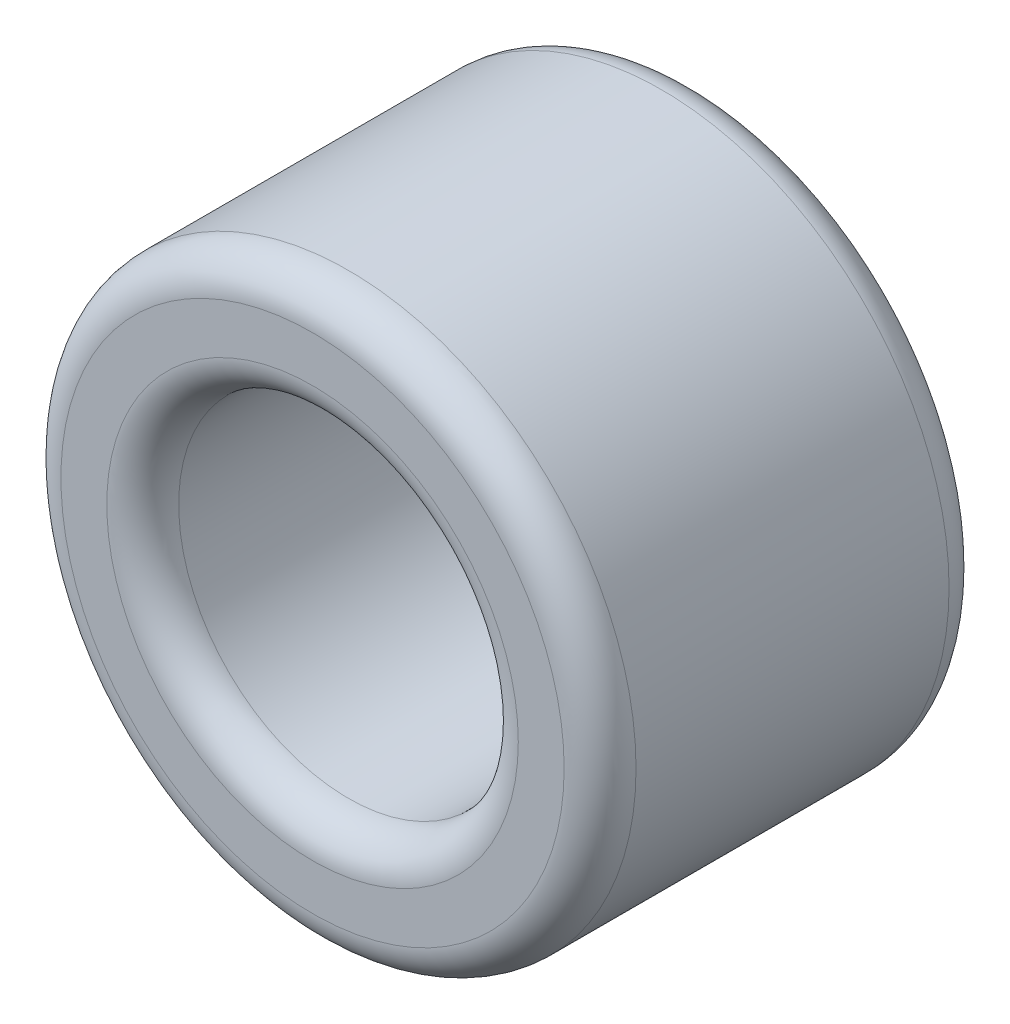
ISO-10303-21;
HEADER;
FILE_DESCRIPTION(('STEP AP214'),'2;1');
FILE_NAME('part.step','',(''),(''),'','','');
FILE_SCHEMA(('AUTOMOTIVE_DESIGN { 1 0 10303 214 1 1 1 1 }'));
ENDSEC;
DATA;
#1=APPLICATION_CONTEXT('core data for automotive mechanical design processes');
#2=APPLICATION_PROTOCOL_DEFINITION('international standard','automotive_design',2000,#1);
#3=PRODUCT_CONTEXT('',#1,'mechanical');
#4=PRODUCT('Part','Part','',(#3));
#5=PRODUCT_RELATED_PRODUCT_CATEGORY('part','',(#4));
#6=PRODUCT_DEFINITION_FORMATION('','',#4);
#7=PRODUCT_DEFINITION_CONTEXT('part definition',#1,'design');
#8=PRODUCT_DEFINITION('design','',#6,#7);
#9=PRODUCT_DEFINITION_SHAPE('','',#8);
#10=(LENGTH_UNIT() NAMED_UNIT(*) SI_UNIT(.MILLI.,.METRE.));
#11=(NAMED_UNIT(*) PLANE_ANGLE_UNIT() SI_UNIT($,.RADIAN.));
#12=(NAMED_UNIT(*) SI_UNIT($,.STERADIAN.) SOLID_ANGLE_UNIT());
#13=UNCERTAINTY_MEASURE_WITH_UNIT(LENGTH_MEASURE(1.E-05),#10,'distance_accuracy_value','');
#14=(GEOMETRIC_REPRESENTATION_CONTEXT(3) GLOBAL_UNCERTAINTY_ASSIGNED_CONTEXT((#13)) GLOBAL_UNIT_ASSIGNED_CONTEXT((#10,
#11,#12)) REPRESENTATION_CONTEXT('',''));
#15=CARTESIAN_POINT('',(0.,0.,0.));
#16=DIRECTION('',(0.,0.,1.));
#17=DIRECTION('',(1.,0.,0.));
#18=AXIS2_PLACEMENT_3D('',#15,#16,#17);
#19=CARTESIAN_POINT('',(0.,0.,170.));
#20=DIRECTION('',(0.,0.,-1.));
#21=DIRECTION('',(-1.,0.,0.));
#22=AXIS2_PLACEMENT_3D('',#19,#20,#21);
#23=CYLINDRICAL_SURFACE('',#22,127.);
#24=CARTESIAN_POINT('',(0.,0.,15.875));
#25=DIRECTION('',(0.,0.,1.));
#26=DIRECTION('',(1.,0.,0.));
#27=AXIS2_PLACEMENT_3D('',#24,#25,#26);
#28=CIRCLE('',#27,127.);
#29=CARTESIAN_POINT('',(127.,0.,15.875));
#30=VERTEX_POINT('',#29);
#31=EDGE_CURVE('E10',#30,#30,#28,.T.);
#32=ORIENTED_EDGE('',*,*,#31,.T.);
#33=EDGE_LOOP('',(#32));
#34=FACE_BOUND('',#33,.T.);
#35=CARTESIAN_POINT('',(0.,0.,154.125));
#36=DIRECTION('',(0.,0.,1.));
#37=DIRECTION('',(1.,0.,0.));
#38=AXIS2_PLACEMENT_3D('',#35,#36,#37);
#39=CIRCLE('',#38,127.);
#40=CARTESIAN_POINT('',(127.,0.,154.125));
#41=VERTEX_POINT('',#40);
#42=EDGE_CURVE('E47',#41,#41,#39,.F.);
#43=ORIENTED_EDGE('',*,*,#42,.T.);
#44=EDGE_LOOP('',(#43));
#45=FACE_BOUND('',#44,.T.);
#46=ADVANCED_FACE('F39',(#34,#45),#23,.T.);
#47=CARTESIAN_POINT('',(0.,0.,170.));
#48=DIRECTION('',(0.,0.,1.));
#49=DIRECTION('',(1.,0.,0.));
#50=AXIS2_PLACEMENT_3D('',#47,#48,#49);
#51=PLANE('',#50);
#52=CARTESIAN_POINT('',(0.,0.,170.));
#53=DIRECTION('',(0.,0.,1.));
#54=DIRECTION('',(1.,0.,0.));
#55=AXIS2_PLACEMENT_3D('',#52,#53,#54);
#56=CIRCLE('',#55,90.875);
#57=CARTESIAN_POINT('',(90.875,0.,170.));
#58=VERTEX_POINT('',#57);
#59=EDGE_CURVE('E63',#58,#58,#56,.F.);
#60=ORIENTED_EDGE('',*,*,#59,.T.);
#61=EDGE_LOOP('',(#60));
#62=FACE_BOUND('',#61,.T.);
#63=CARTESIAN_POINT('',(0.,0.,170.));
#64=DIRECTION('',(0.,0.,1.));
#65=DIRECTION('',(1.,0.,0.));
#66=AXIS2_PLACEMENT_3D('',#63,#64,#65);
#67=CIRCLE('',#66,111.125);
#68=CARTESIAN_POINT('',(111.125,0.,170.));
#69=VERTEX_POINT('',#68);
#70=EDGE_CURVE('E67',#69,#69,#67,.T.);
#71=ORIENTED_EDGE('',*,*,#70,.T.);
#72=EDGE_LOOP('',(#71));
#73=FACE_BOUND('',#72,.T.);
#74=ADVANCED_FACE('F93',(#62,#73),#51,.T.);
#75=CARTESIAN_POINT('',(0.,0.,0.));
#76=DIRECTION('',(0.,0.,1.));
#77=DIRECTION('',(1.,0.,0.));
#78=AXIS2_PLACEMENT_3D('',#75,#76,#77);
#79=PLANE('',#78);
#80=CARTESIAN_POINT('',(0.,0.,0.));
#81=DIRECTION('',(0.,0.,1.));
#82=DIRECTION('',(1.,0.,0.));
#83=AXIS2_PLACEMENT_3D('',#80,#81,#82);
#84=CIRCLE('',#83,90.875);
#85=CARTESIAN_POINT('',(90.875,0.,0.));
#86=VERTEX_POINT('',#85);
#87=EDGE_CURVE('E52',#86,#86,#84,.T.);
#88=ORIENTED_EDGE('',*,*,#87,.T.);
#89=EDGE_LOOP('',(#88));
#90=FACE_BOUND('',#89,.T.);
#91=CARTESIAN_POINT('',(0.,0.,0.));
#92=DIRECTION('',(0.,0.,1.));
#93=DIRECTION('',(1.,0.,0.));
#94=AXIS2_PLACEMENT_3D('',#91,#92,#93);
#95=CIRCLE('',#94,111.125);
#96=CARTESIAN_POINT('',(111.125,0.,0.));
#97=VERTEX_POINT('',#96);
#98=EDGE_CURVE('E57',#97,#97,#95,.F.);
#99=ORIENTED_EDGE('',*,*,#98,.T.);
#100=EDGE_LOOP('',(#99));
#101=FACE_BOUND('',#100,.T.);
#102=ADVANCED_FACE('F90',(#90,#101),#79,.F.);
#103=CARTESIAN_POINT('',(0.,0.,0.));
#104=DIRECTION('',(0.,0.,1.));
#105=DIRECTION('',(1.,0.,0.));
#106=AXIS2_PLACEMENT_3D('',#103,#104,#105);
#107=CYLINDRICAL_SURFACE('',#106,75.);
#108=CARTESIAN_POINT('',(0.,0.,154.125));
#109=DIRECTION('',(0.,0.,1.));
#110=DIRECTION('',(1.,0.,0.));
#111=AXIS2_PLACEMENT_3D('',#108,#109,#110);
#112=CIRCLE('',#111,75.);
#113=CARTESIAN_POINT('',(75.,0.,154.125));
#114=VERTEX_POINT('',#113);
#115=EDGE_CURVE('E71',#114,#114,#112,.T.);
#116=ORIENTED_EDGE('',*,*,#115,.T.);
#117=EDGE_LOOP('',(#116));
#118=FACE_BOUND('',#117,.T.);
#119=CARTESIAN_POINT('',(0.,0.,15.875));
#120=DIRECTION('',(0.,0.,1.));
#121=DIRECTION('',(1.,0.,0.));
#122=AXIS2_PLACEMENT_3D('',#119,#120,#121);
#123=CIRCLE('',#122,75.);
#124=CARTESIAN_POINT('',(75.,0.,15.875));
#125=VERTEX_POINT('',#124);
#126=EDGE_CURVE('E75',#125,#125,#123,.F.);
#127=ORIENTED_EDGE('',*,*,#126,.T.);
#128=EDGE_LOOP('',(#127));
#129=FACE_BOUND('',#128,.T.);
#130=ADVANCED_FACE('F80',(#118,#129),#107,.F.);
#131=CARTESIAN_POINT('',(0.,0.,154.125));
#132=DIRECTION('',(0.,0.,1.));
#133=DIRECTION('',(1.,0.,0.));
#134=AXIS2_PLACEMENT_3D('',#131,#132,#133);
#135=TOROIDAL_SURFACE('',#134,90.875,15.875);
#136=ORIENTED_EDGE('',*,*,#59,.F.);
#137=EDGE_LOOP('',(#136));
#138=FACE_BOUND('',#137,.T.);
#139=ORIENTED_EDGE('',*,*,#115,.F.);
#140=EDGE_LOOP('',(#139));
#141=FACE_BOUND('',#140,.T.);
#142=ADVANCED_FACE('F86',(#138,#141),#135,.T.);
#143=CARTESIAN_POINT('',(0.,0.,15.875));
#144=DIRECTION('',(0.,0.,1.));
#145=DIRECTION('',(1.,0.,0.));
#146=AXIS2_PLACEMENT_3D('',#143,#144,#145);
#147=TOROIDAL_SURFACE('',#146,90.875,15.875);
#148=ORIENTED_EDGE('',*,*,#126,.F.);
#149=EDGE_LOOP('',(#148));
#150=FACE_BOUND('',#149,.T.);
#151=ORIENTED_EDGE('',*,*,#87,.F.);
#152=EDGE_LOOP('',(#151));
#153=FACE_BOUND('',#152,.T.);
#154=ADVANCED_FACE('F82',(#150,#153),#147,.T.);
#155=CARTESIAN_POINT('',(0.,0.,15.875));
#156=DIRECTION('',(0.,0.,1.));
#157=DIRECTION('',(1.,0.,0.));
#158=AXIS2_PLACEMENT_3D('',#155,#156,#157);
#159=TOROIDAL_SURFACE('',#158,111.125,15.875);
#160=ORIENTED_EDGE('',*,*,#98,.F.);
#161=EDGE_LOOP('',(#160));
#162=FACE_BOUND('',#161,.T.);
#163=ORIENTED_EDGE('',*,*,#31,.F.);
#164=EDGE_LOOP('',(#163));
#165=FACE_BOUND('',#164,.T.);
#166=ADVANCED_FACE('F85',(#162,#165),#159,.T.);
#167=CARTESIAN_POINT('',(0.,0.,154.125));
#168=DIRECTION('',(0.,0.,1.));
#169=DIRECTION('',(1.,0.,0.));
#170=AXIS2_PLACEMENT_3D('',#167,#168,#169);
#171=TOROIDAL_SURFACE('',#170,111.125,15.875);
#172=ORIENTED_EDGE('',*,*,#42,.F.);
#173=EDGE_LOOP('',(#172));
#174=FACE_BOUND('',#173,.T.);
#175=ORIENTED_EDGE('',*,*,#70,.F.);
#176=EDGE_LOOP('',(#175));
#177=FACE_BOUND('',#176,.T.);
#178=ADVANCED_FACE('F41',(#174,#177),#171,.T.);
#179=CLOSED_SHELL('',(#46,#74,#102,#130,#142,#154,#166,#178));
#180=MANIFOLD_SOLID_BREP('B2',#179);
#181=ADVANCED_BREP_SHAPE_REPRESENTATION('',(#18,#180),#14);
#182=SHAPE_DEFINITION_REPRESENTATION(#9,#181);
ENDSEC;
END-ISO-10303-21;
